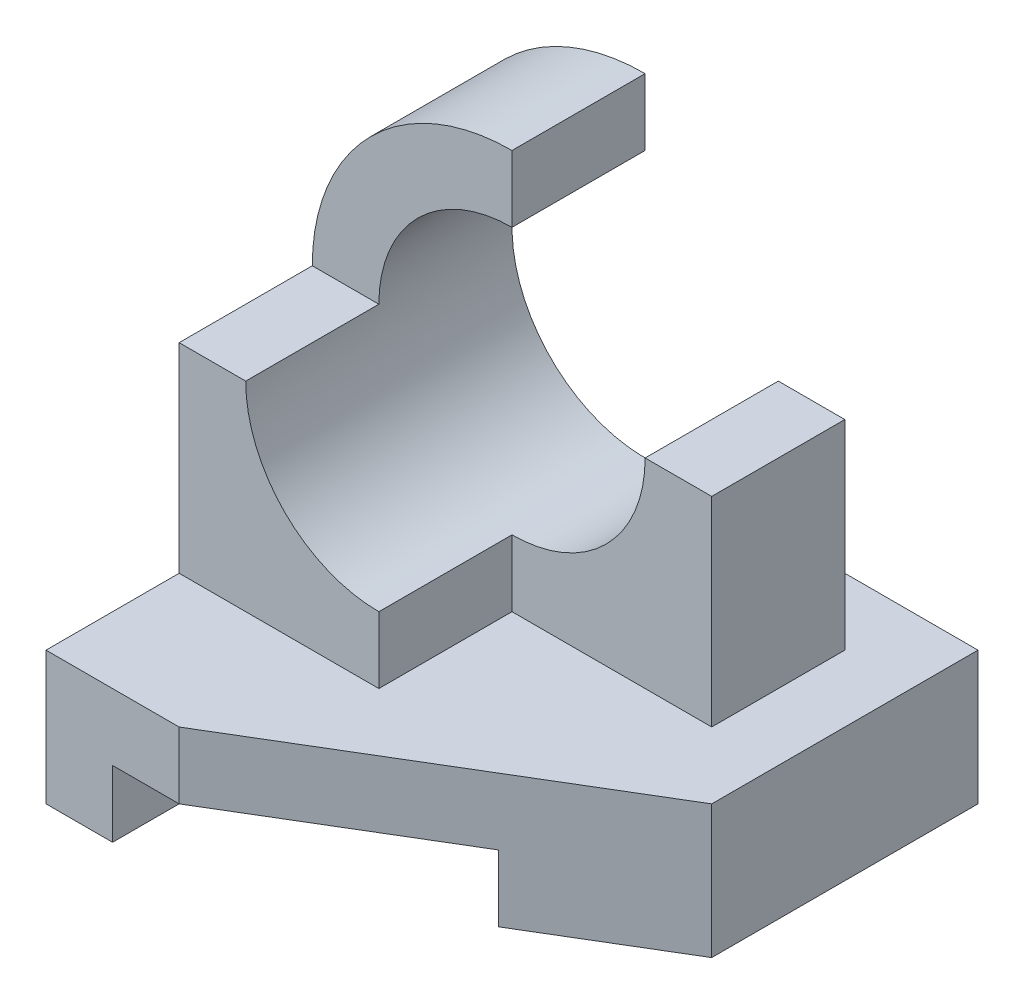
ISO-10303-21;
HEADER;
FILE_DESCRIPTION(('STEP AP214'),'2;1');
FILE_NAME('part.step','',(''),(''),'','','');
FILE_SCHEMA(('AUTOMOTIVE_DESIGN { 1 0 10303 214 1 1 1 1 }'));
ENDSEC;
DATA;
#1=APPLICATION_CONTEXT('core data for automotive mechanical design processes');
#2=APPLICATION_PROTOCOL_DEFINITION('international standard','automotive_design',2000,#1);
#3=PRODUCT_CONTEXT('',#1,'mechanical');
#4=PRODUCT('Part','Part','',(#3));
#5=PRODUCT_RELATED_PRODUCT_CATEGORY('part','',(#4));
#6=PRODUCT_DEFINITION_FORMATION('','',#4);
#7=PRODUCT_DEFINITION_CONTEXT('part definition',#1,'design');
#8=PRODUCT_DEFINITION('design','',#6,#7);
#9=PRODUCT_DEFINITION_SHAPE('','',#8);
#10=(LENGTH_UNIT() NAMED_UNIT(*) SI_UNIT(.MILLI.,.METRE.));
#11=(NAMED_UNIT(*) PLANE_ANGLE_UNIT() SI_UNIT($,.RADIAN.));
#12=(NAMED_UNIT(*) SI_UNIT($,.STERADIAN.) SOLID_ANGLE_UNIT());
#13=UNCERTAINTY_MEASURE_WITH_UNIT(LENGTH_MEASURE(1.E-05),#10,'distance_accuracy_value','');
#14=(GEOMETRIC_REPRESENTATION_CONTEXT(3) GLOBAL_UNCERTAINTY_ASSIGNED_CONTEXT((#13)) GLOBAL_UNIT_ASSIGNED_CONTEXT((#10,
#11,#12)) REPRESENTATION_CONTEXT('',''));
#15=CARTESIAN_POINT('',(0.,0.,0.));
#16=DIRECTION('',(0.,0.,1.));
#17=DIRECTION('',(1.,0.,0.));
#18=AXIS2_PLACEMENT_3D('',#15,#16,#17);
#19=CARTESIAN_POINT('',(3.5,1.,7.));
#20=DIRECTION('',(0.,-1.,0.));
#21=DIRECTION('',(1.,0.,0.));
#22=AXIS2_PLACEMENT_3D('',#19,#20,#21);
#23=PLANE('',#22);
#24=DIRECTION('',(0.,0.,-1.));
#25=VECTOR('',#24,1.);
#26=CARTESIAN_POINT('',(-3.5,1.,7.));
#27=LINE('',#26,#25);
#28=CARTESIAN_POINT('',(-3.5,1.,1.));
#29=VERTEX_POINT('',#28);
#30=CARTESIAN_POINT('',(-3.5,1.,0.));
#31=VERTEX_POINT('',#30);
#32=EDGE_CURVE('E39',#29,#31,#27,.T.);
#33=ORIENTED_EDGE('',*,*,#32,.F.);
#34=DIRECTION('',(-1.,0.,0.));
#35=VECTOR('',#34,1.);
#36=CARTESIAN_POINT('',(0.,1.,1.));
#37=LINE('',#36,#35);
#38=CARTESIAN_POINT('',(2.5,1.,1.));
#39=VERTEX_POINT('',#38);
#40=EDGE_CURVE('E319',#39,#29,#37,.T.);
#41=ORIENTED_EDGE('',*,*,#40,.F.);
#42=DIRECTION('',(0.,0.,1.));
#43=VECTOR('',#42,1.);
#44=CARTESIAN_POINT('',(2.5,1.,1.));
#45=LINE('',#44,#43);
#46=CARTESIAN_POINT('',(2.5,1.,3.));
#47=VERTEX_POINT('',#46);
#48=EDGE_CURVE('E358',#39,#47,#45,.T.);
#49=ORIENTED_EDGE('',*,*,#48,.T.);
#50=DIRECTION('',(-1.,0.,0.));
#51=VECTOR('',#50,1.);
#52=CARTESIAN_POINT('',(0.,1.,3.));
#53=LINE('',#52,#51);
#54=CARTESIAN_POINT('',(-0.500000000000004,1.,3.));
#55=VERTEX_POINT('',#54);
#56=EDGE_CURVE('E344',#47,#55,#53,.T.);
#57=ORIENTED_EDGE('',*,*,#56,.T.);
#58=DIRECTION('',(0.,0.,-1.));
#59=VECTOR('',#58,1.);
#60=CARTESIAN_POINT('',(-0.500000000000004,1.,3.));
#61=LINE('',#60,#59);
#62=CARTESIAN_POINT('',(-0.500000000000004,1.,5.));
#63=VERTEX_POINT('',#62);
#64=EDGE_CURVE('E198',#63,#55,#61,.T.);
#65=ORIENTED_EDGE('',*,*,#64,.F.);
#66=DIRECTION('',(1.,0.,0.));
#67=VECTOR('',#66,1.);
#68=CARTESIAN_POINT('',(-0.500000000000004,1.,5.));
#69=LINE('',#68,#67);
#70=CARTESIAN_POINT('',(-3.5,1.,5.));
#71=VERTEX_POINT('',#70);
#72=EDGE_CURVE('E60',#71,#63,#69,.T.);
#73=ORIENTED_EDGE('',*,*,#72,.F.);
#74=CARTESIAN_POINT('',(-3.5,1.,7.));
#75=VERTEX_POINT('',#74);
#76=EDGE_CURVE('E269',#75,#71,#27,.T.);
#77=ORIENTED_EDGE('',*,*,#76,.F.);
#78=DIRECTION('',(-1.,0.,0.));
#79=VECTOR('',#78,1.);
#80=CARTESIAN_POINT('',(3.5,1.,7.));
#81=LINE('',#80,#79);
#82=CARTESIAN_POINT('',(-1.5,1.,7.));
#83=VERTEX_POINT('',#82);
#84=EDGE_CURVE('E251',#83,#75,#81,.T.);
#85=ORIENTED_EDGE('',*,*,#84,.F.);
#86=DIRECTION('',(-0.857492925712544,0.,0.514495755427526));
#87=VECTOR('',#86,1.);
#88=CARTESIAN_POINT('',(3.5,1.,4.));
#89=LINE('',#88,#87);
#90=CARTESIAN_POINT('',(3.5,1.,4.));
#91=VERTEX_POINT('',#90);
#92=EDGE_CURVE('E226',#91,#83,#89,.T.);
#93=ORIENTED_EDGE('',*,*,#92,.F.);
#94=DIRECTION('',(0.,0.,-1.));
#95=VECTOR('',#94,1.);
#96=CARTESIAN_POINT('',(3.5,1.,7.));
#97=LINE('',#96,#95);
#98=CARTESIAN_POINT('',(3.5,1.,0.));
#99=VERTEX_POINT('',#98);
#100=EDGE_CURVE('E265',#91,#99,#97,.T.);
#101=ORIENTED_EDGE('',*,*,#100,.T.);
#102=DIRECTION('',(-1.,0.,0.));
#103=VECTOR('',#102,1.);
#104=CARTESIAN_POINT('',(3.5,1.,0.));
#105=LINE('',#104,#103);
#106=EDGE_CURVE('E248',#99,#31,#105,.T.);
#107=ORIENTED_EDGE('',*,*,#106,.T.);
#108=EDGE_LOOP('',(#33,#41,#49,#57,#65,#73,#77,#85,#93,#101,#107));
#109=FACE_BOUND('',#108,.T.);
#110=ADVANCED_FACE('F35',(#109),#23,.F.);
#111=CARTESIAN_POINT('',(3.5,-0.999999999999999,7.));
#112=DIRECTION('',(0.,1.,0.));
#113=DIRECTION('',(-1.,0.,0.));
#114=AXIS2_PLACEMENT_3D('',#111,#112,#113);
#115=PLANE('',#114);
#116=DIRECTION('',(1.,0.,0.));
#117=VECTOR('',#116,1.);
#118=CARTESIAN_POINT('',(3.5,-0.999999999999999,0.));
#119=LINE('',#118,#117);
#120=CARTESIAN_POINT('',(-3.5,-1.,0.));
#121=VERTEX_POINT('',#120);
#122=CARTESIAN_POINT('',(-2.5,-1.,0.));
#123=VERTEX_POINT('',#122);
#124=EDGE_CURVE('E256',#121,#123,#119,.T.);
#125=ORIENTED_EDGE('',*,*,#124,.T.);
#126=DIRECTION('',(0.,0.,1.));
#127=VECTOR('',#126,1.);
#128=CARTESIAN_POINT('',(-2.5,-1.,0.));
#129=LINE('',#128,#127);
#130=CARTESIAN_POINT('',(-2.5,-1.,7.));
#131=VERTEX_POINT('',#130);
#132=EDGE_CURVE('E223',#123,#131,#129,.T.);
#133=ORIENTED_EDGE('',*,*,#132,.T.);
#134=DIRECTION('',(1.,0.,0.));
#135=VECTOR('',#134,1.);
#136=CARTESIAN_POINT('',(3.5,-0.999999999999999,7.));
#137=LINE('',#136,#135);
#138=CARTESIAN_POINT('',(-3.5,-1.,7.));
#139=VERTEX_POINT('',#138);
#140=EDGE_CURVE('E247',#139,#131,#137,.T.);
#141=ORIENTED_EDGE('',*,*,#140,.F.);
#142=DIRECTION('',(0.,0.,-1.));
#143=VECTOR('',#142,1.);
#144=CARTESIAN_POINT('',(-3.5,-1.,7.));
#145=LINE('',#144,#143);
#146=EDGE_CURVE('E304',#139,#121,#145,.T.);
#147=ORIENTED_EDGE('',*,*,#146,.T.);
#148=EDGE_LOOP('',(#125,#133,#141,#147));
#149=FACE_BOUND('',#148,.T.);
#150=ADVANCED_FACE('F380',(#149),#115,.F.);
#151=CARTESIAN_POINT('',(-3.5,-1.,7.));
#152=DIRECTION('',(1.,0.,0.));
#153=DIRECTION('',(0.,0.,-1.));
#154=AXIS2_PLACEMENT_3D('',#151,#152,#153);
#155=PLANE('',#154);
#156=DIRECTION('',(0.,1.,0.));
#157=VECTOR('',#156,1.);
#158=CARTESIAN_POINT('',(-3.5,0.,1.));
#159=LINE('',#158,#157);
#160=CARTESIAN_POINT('',(-3.5,4.,1.));
#161=VERTEX_POINT('',#160);
#162=EDGE_CURVE('E320',#29,#161,#159,.T.);
#163=ORIENTED_EDGE('',*,*,#162,.F.);
#164=ORIENTED_EDGE('',*,*,#32,.T.);
#165=DIRECTION('',(0.,-1.,0.));
#166=VECTOR('',#165,1.);
#167=CARTESIAN_POINT('',(-3.5,-1.,0.));
#168=LINE('',#167,#166);
#169=EDGE_CURVE('E242',#31,#121,#168,.T.);
#170=ORIENTED_EDGE('',*,*,#169,.T.);
#171=ORIENTED_EDGE('',*,*,#146,.F.);
#172=DIRECTION('',(0.,-1.,0.));
#173=VECTOR('',#172,1.);
#174=CARTESIAN_POINT('',(-3.5,-1.,7.));
#175=LINE('',#174,#173);
#176=EDGE_CURVE('E244',#75,#139,#175,.T.);
#177=ORIENTED_EDGE('',*,*,#176,.F.);
#178=ORIENTED_EDGE('',*,*,#76,.T.);
#179=DIRECTION('',(0.,-1.,0.));
#180=VECTOR('',#179,1.);
#181=CARTESIAN_POINT('',(-3.5,4.,5.));
#182=LINE('',#181,#180);
#183=CARTESIAN_POINT('',(-3.5,4.,5.));
#184=VERTEX_POINT('',#183);
#185=EDGE_CURVE('E206',#184,#71,#182,.T.);
#186=ORIENTED_EDGE('',*,*,#185,.F.);
#187=DIRECTION('',(0.,0.,1.));
#188=VECTOR('',#187,1.);
#189=CARTESIAN_POINT('',(-3.5,4.,5.));
#190=LINE('',#189,#188);
#191=CARTESIAN_POINT('',(-3.5,4.,3.));
#192=VERTEX_POINT('',#191);
#193=EDGE_CURVE('E195',#192,#184,#190,.T.);
#194=ORIENTED_EDGE('',*,*,#193,.F.);
#195=DIRECTION('',(0.,0.,1.));
#196=VECTOR('',#195,1.);
#197=CARTESIAN_POINT('',(-3.5,4.,1.));
#198=LINE('',#197,#196);
#199=EDGE_CURVE('E322',#161,#192,#198,.T.);
#200=ORIENTED_EDGE('',*,*,#199,.F.);
#201=EDGE_LOOP('',(#163,#164,#170,#171,#177,#178,#186,#194,#200));
#202=FACE_BOUND('',#201,.T.);
#203=ADVANCED_FACE('F37',(#202),#155,.F.);
#204=DIRECTION('',(-0.857492925712544,0.,0.514495755427526));
#205=VECTOR('',#204,1.);
#206=CARTESIAN_POINT('',(3.5,-1.,4.));
#207=LINE('',#206,#205);
#208=CARTESIAN_POINT('',(3.5,-1.,4.));
#209=VERTEX_POINT('',#208);
#210=CARTESIAN_POINT('',(1.5,-1.,5.2));
#211=VERTEX_POINT('',#210);
#212=EDGE_CURVE('E234',#209,#211,#207,.T.);
#213=ORIENTED_EDGE('',*,*,#212,.T.);
#214=DIRECTION('',(0.,0.,1.));
#215=VECTOR('',#214,1.);
#216=CARTESIAN_POINT('',(1.5,-1.,0.));
#217=LINE('',#216,#215);
#218=CARTESIAN_POINT('',(1.5,-1.,0.));
#219=VERTEX_POINT('',#218);
#220=EDGE_CURVE('E220',#219,#211,#217,.T.);
#221=ORIENTED_EDGE('',*,*,#220,.F.);
#222=CARTESIAN_POINT('',(3.5,-0.999999999999999,0.));
#223=VERTEX_POINT('',#222);
#224=EDGE_CURVE('E255',#219,#223,#119,.T.);
#225=ORIENTED_EDGE('',*,*,#224,.T.);
#226=DIRECTION('',(0.,0.,-1.));
#227=VECTOR('',#226,1.);
#228=CARTESIAN_POINT('',(3.5,-0.999999999999999,7.));
#229=LINE('',#228,#227);
#230=EDGE_CURVE('E298',#209,#223,#229,.T.);
#231=ORIENTED_EDGE('',*,*,#230,.F.);
#232=EDGE_LOOP('',(#213,#221,#225,#231));
#233=FACE_BOUND('',#232,.T.);
#234=ADVANCED_FACE('F301',(#233),#115,.F.);
#235=CARTESIAN_POINT('',(3.5,-0.999999999999999,7.));
#236=DIRECTION('',(-1.,0.,0.));
#237=DIRECTION('',(0.,0.,1.));
#238=AXIS2_PLACEMENT_3D('',#235,#236,#237);
#239=PLANE('',#238);
#240=ORIENTED_EDGE('',*,*,#100,.F.);
#241=DIRECTION('',(0.,1.,0.));
#242=VECTOR('',#241,1.);
#243=CARTESIAN_POINT('',(3.5,-1.,4.));
#244=LINE('',#243,#242);
#245=EDGE_CURVE('E237',#209,#91,#244,.T.);
#246=ORIENTED_EDGE('',*,*,#245,.F.);
#247=ORIENTED_EDGE('',*,*,#230,.T.);
#248=DIRECTION('',(0.,1.,0.));
#249=VECTOR('',#248,1.);
#250=CARTESIAN_POINT('',(3.5,-0.999999999999999,0.));
#251=LINE('',#250,#249);
#252=EDGE_CURVE('E259',#223,#99,#251,.T.);
#253=ORIENTED_EDGE('',*,*,#252,.T.);
#254=EDGE_LOOP('',(#240,#246,#247,#253));
#255=FACE_BOUND('',#254,.T.);
#256=ADVANCED_FACE('F297',(#255),#239,.F.);
#257=CARTESIAN_POINT('',(0.,0.,7.));
#258=DIRECTION('',(0.,0.,1.));
#259=DIRECTION('',(1.,0.,0.));
#260=AXIS2_PLACEMENT_3D('',#257,#258,#259);
#261=PLANE('',#260);
#262=DIRECTION('',(0.,-1.,0.));
#263=VECTOR('',#262,1.);
#264=CARTESIAN_POINT('',(-2.5,-1.,7.));
#265=LINE('',#264,#263);
#266=CARTESIAN_POINT('',(-2.5,0.,7.));
#267=VERTEX_POINT('',#266);
#268=EDGE_CURVE('E214',#267,#131,#265,.T.);
#269=ORIENTED_EDGE('',*,*,#268,.F.);
#270=DIRECTION('',(-1.,0.,0.));
#271=VECTOR('',#270,1.);
#272=CARTESIAN_POINT('',(-2.5,0.,7.));
#273=LINE('',#272,#271);
#274=CARTESIAN_POINT('',(-1.50000000000001,0.,7.));
#275=VERTEX_POINT('',#274);
#276=EDGE_CURVE('E209',#275,#267,#273,.T.);
#277=ORIENTED_EDGE('',*,*,#276,.F.);
#278=DIRECTION('',(0.,1.,0.));
#279=VECTOR('',#278,1.);
#280=CARTESIAN_POINT('',(-1.5,-1.,7.));
#281=LINE('',#280,#279);
#282=EDGE_CURVE('E240',#275,#83,#281,.T.);
#283=ORIENTED_EDGE('',*,*,#282,.T.);
#284=ORIENTED_EDGE('',*,*,#84,.T.);
#285=ORIENTED_EDGE('',*,*,#176,.T.);
#286=ORIENTED_EDGE('',*,*,#140,.T.);
#287=EDGE_LOOP('',(#269,#277,#283,#284,#285,#286));
#288=FACE_BOUND('',#287,.T.);
#289=ADVANCED_FACE('F287',(#288),#261,.T.);
#290=CARTESIAN_POINT('',(0.,0.,0.));
#291=DIRECTION('',(0.,0.,1.));
#292=DIRECTION('',(1.,0.,0.));
#293=AXIS2_PLACEMENT_3D('',#290,#291,#292);
#294=PLANE('',#293);
#295=DIRECTION('',(-1.,0.,0.));
#296=VECTOR('',#295,1.);
#297=CARTESIAN_POINT('',(-2.5,0.,0.));
#298=LINE('',#297,#296);
#299=CARTESIAN_POINT('',(1.5,0.,0.));
#300=VERTEX_POINT('',#299);
#301=CARTESIAN_POINT('',(-2.5,0.,0.));
#302=VERTEX_POINT('',#301);
#303=EDGE_CURVE('E213',#300,#302,#298,.T.);
#304=ORIENTED_EDGE('',*,*,#303,.T.);
#305=DIRECTION('',(0.,-1.,0.));
#306=VECTOR('',#305,1.);
#307=CARTESIAN_POINT('',(-2.5,-1.,0.));
#308=LINE('',#307,#306);
#309=EDGE_CURVE('E217',#302,#123,#308,.T.);
#310=ORIENTED_EDGE('',*,*,#309,.T.);
#311=ORIENTED_EDGE('',*,*,#124,.F.);
#312=ORIENTED_EDGE('',*,*,#169,.F.);
#313=ORIENTED_EDGE('',*,*,#106,.F.);
#314=ORIENTED_EDGE('',*,*,#252,.F.);
#315=ORIENTED_EDGE('',*,*,#224,.F.);
#316=DIRECTION('',(0.,1.,0.));
#317=VECTOR('',#316,1.);
#318=CARTESIAN_POINT('',(1.5,0.,0.));
#319=LINE('',#318,#317);
#320=EDGE_CURVE('E210',#219,#300,#319,.T.);
#321=ORIENTED_EDGE('',*,*,#320,.T.);
#322=EDGE_LOOP('',(#304,#310,#311,#312,#313,#314,#315,#321));
#323=FACE_BOUND('',#322,.T.);
#324=ADVANCED_FACE('F314',(#323),#294,.F.);
#325=CARTESIAN_POINT('',(3.5,-1.,4.));
#326=DIRECTION('',(-0.514495755427526,0.,-0.857492925712544));
#327=DIRECTION('',(-0.857492925712544,0.,0.514495755427526));
#328=AXIS2_PLACEMENT_3D('',#325,#326,#327);
#329=PLANE('',#328);
#330=ORIENTED_EDGE('',*,*,#282,.F.);
#331=DIRECTION('',(0.857492925712544,0.,-0.514495755427526));
#332=VECTOR('',#331,1.);
#333=CARTESIAN_POINT('',(3.5,0.,4.));
#334=LINE('',#333,#332);
#335=CARTESIAN_POINT('',(1.5,0.,5.2));
#336=VERTEX_POINT('',#335);
#337=EDGE_CURVE('E11',#275,#336,#334,.T.);
#338=ORIENTED_EDGE('',*,*,#337,.T.);
#339=DIRECTION('',(0.,-1.,0.));
#340=VECTOR('',#339,1.);
#341=CARTESIAN_POINT('',(1.5,-1.,5.2));
#342=LINE('',#341,#340);
#343=EDGE_CURVE('E45',#336,#211,#342,.T.);
#344=ORIENTED_EDGE('',*,*,#343,.T.);
#345=ORIENTED_EDGE('',*,*,#212,.F.);
#346=ORIENTED_EDGE('',*,*,#245,.T.);
#347=ORIENTED_EDGE('',*,*,#92,.T.);
#348=EDGE_LOOP('',(#330,#338,#344,#345,#346,#347));
#349=FACE_BOUND('',#348,.T.);
#350=ADVANCED_FACE('F291',(#349),#329,.F.);
#351=CARTESIAN_POINT('',(-2.5,0.,0.));
#352=DIRECTION('',(0.,1.,0.));
#353=DIRECTION('',(-1.,0.,0.));
#354=AXIS2_PLACEMENT_3D('',#351,#352,#353);
#355=PLANE('',#354);
#356=ORIENTED_EDGE('',*,*,#276,.T.);
#357=DIRECTION('',(0.,0.,1.));
#358=VECTOR('',#357,1.);
#359=CARTESIAN_POINT('',(-2.5,0.,0.));
#360=LINE('',#359,#358);
#361=EDGE_CURVE('E227',#302,#267,#360,.T.);
#362=ORIENTED_EDGE('',*,*,#361,.F.);
#363=ORIENTED_EDGE('',*,*,#303,.F.);
#364=DIRECTION('',(0.,0.,1.));
#365=VECTOR('',#364,1.);
#366=CARTESIAN_POINT('',(1.5,0.,0.));
#367=LINE('',#366,#365);
#368=EDGE_CURVE('E230',#300,#336,#367,.T.);
#369=ORIENTED_EDGE('',*,*,#368,.T.);
#370=ORIENTED_EDGE('',*,*,#337,.F.);
#371=EDGE_LOOP('',(#356,#362,#363,#369,#370));
#372=FACE_BOUND('',#371,.T.);
#373=ADVANCED_FACE('F311',(#372),#355,.F.);
#374=CARTESIAN_POINT('',(1.5,0.,0.));
#375=DIRECTION('',(1.,0.,0.));
#376=DIRECTION('',(0.,0.,-1.));
#377=AXIS2_PLACEMENT_3D('',#374,#375,#376);
#378=PLANE('',#377);
#379=ORIENTED_EDGE('',*,*,#368,.F.);
#380=ORIENTED_EDGE('',*,*,#320,.F.);
#381=ORIENTED_EDGE('',*,*,#220,.T.);
#382=ORIENTED_EDGE('',*,*,#343,.F.);
#383=EDGE_LOOP('',(#379,#380,#381,#382));
#384=FACE_BOUND('',#383,.T.);
#385=ADVANCED_FACE('F308',(#384),#378,.F.);
#386=CARTESIAN_POINT('',(-2.5,-1.,0.));
#387=DIRECTION('',(-1.,0.,0.));
#388=DIRECTION('',(0.,0.,1.));
#389=AXIS2_PLACEMENT_3D('',#386,#387,#388);
#390=PLANE('',#389);
#391=ORIENTED_EDGE('',*,*,#268,.T.);
#392=ORIENTED_EDGE('',*,*,#132,.F.);
#393=ORIENTED_EDGE('',*,*,#309,.F.);
#394=ORIENTED_EDGE('',*,*,#361,.T.);
#395=EDGE_LOOP('',(#391,#392,#393,#394));
#396=FACE_BOUND('',#395,.T.);
#397=ADVANCED_FACE('F377',(#396),#390,.F.);
#398=CARTESIAN_POINT('',(-0.500000000000004,4.,5.));
#399=DIRECTION('',(0.,0.,-1.));
#400=DIRECTION('',(-1.,0.,0.));
#401=AXIS2_PLACEMENT_3D('',#398,#399,#400);
#402=PLANE('',#401);
#403=DIRECTION('',(0.,-1.,0.));
#404=VECTOR('',#403,1.);
#405=CARTESIAN_POINT('',(-0.500000000000004,4.,5.));
#406=LINE('',#405,#404);
#407=CARTESIAN_POINT('',(-0.500000000000004,2.,5.));
#408=VERTEX_POINT('',#407);
#409=EDGE_CURVE('E53',#408,#63,#406,.T.);
#410=ORIENTED_EDGE('',*,*,#409,.F.);
#411=CARTESIAN_POINT('',(-0.500000000000004,4.,5.));
#412=DIRECTION('',(0.,0.,-1.));
#413=DIRECTION('',(-1.,0.,0.));
#414=AXIS2_PLACEMENT_3D('',#411,#412,#413);
#415=CIRCLE('',#414,2.);
#416=CARTESIAN_POINT('',(-2.5,4.,5.));
#417=VERTEX_POINT('',#416);
#418=EDGE_CURVE('E178',#408,#417,#415,.T.);
#419=ORIENTED_EDGE('',*,*,#418,.T.);
#420=DIRECTION('',(1.,0.,0.));
#421=VECTOR('',#420,1.);
#422=CARTESIAN_POINT('',(-0.500000000000004,4.,5.));
#423=LINE('',#422,#421);
#424=EDGE_CURVE('E190',#184,#417,#423,.T.);
#425=ORIENTED_EDGE('',*,*,#424,.F.);
#426=ORIENTED_EDGE('',*,*,#185,.T.);
#427=ORIENTED_EDGE('',*,*,#72,.T.);
#428=EDGE_LOOP('',(#410,#419,#425,#426,#427));
#429=FACE_BOUND('',#428,.T.);
#430=ADVANCED_FACE('F188',(#429),#402,.F.);
#431=CARTESIAN_POINT('',(-0.500000000000004,4.,3.));
#432=DIRECTION('',(-1.,0.,0.));
#433=DIRECTION('',(0.,-1.,0.));
#434=AXIS2_PLACEMENT_3D('',#431,#432,#433);
#435=PLANE('',#434);
#436=DIRECTION('',(0.,-1.,0.));
#437=VECTOR('',#436,1.);
#438=CARTESIAN_POINT('',(-0.500000000000004,4.,3.));
#439=LINE('',#438,#437);
#440=CARTESIAN_POINT('',(-0.500000000000004,2.,3.));
#441=VERTEX_POINT('',#440);
#442=EDGE_CURVE('E203',#441,#55,#439,.T.);
#443=ORIENTED_EDGE('',*,*,#442,.F.);
#444=DIRECTION('',(0.,0.,-1.));
#445=VECTOR('',#444,1.);
#446=CARTESIAN_POINT('',(-0.500000000000004,2.,6.));
#447=LINE('',#446,#445);
#448=EDGE_CURVE('E191',#441,#408,#447,.F.);
#449=ORIENTED_EDGE('',*,*,#448,.T.);
#450=ORIENTED_EDGE('',*,*,#409,.T.);
#451=ORIENTED_EDGE('',*,*,#64,.T.);
#452=EDGE_LOOP('',(#443,#449,#450,#451));
#453=FACE_BOUND('',#452,.T.);
#454=ADVANCED_FACE('F369',(#453),#435,.F.);
#455=CARTESIAN_POINT('',(0.,4.,0.));
#456=DIRECTION('',(0.,-1.,0.));
#457=DIRECTION('',(1.,0.,0.));
#458=AXIS2_PLACEMENT_3D('',#455,#456,#457);
#459=PLANE('',#458);
#460=ORIENTED_EDGE('',*,*,#424,.T.);
#461=DIRECTION('',(0.,0.,-1.));
#462=VECTOR('',#461,1.);
#463=CARTESIAN_POINT('',(-2.5,4.,6.));
#464=LINE('',#463,#462);
#465=CARTESIAN_POINT('',(-2.5,4.,3.));
#466=VERTEX_POINT('',#465);
#467=EDGE_CURVE('E174',#417,#466,#464,.T.);
#468=ORIENTED_EDGE('',*,*,#467,.T.);
#469=DIRECTION('',(-1.,0.,0.));
#470=VECTOR('',#469,1.);
#471=CARTESIAN_POINT('',(-3.5,4.,3.));
#472=LINE('',#471,#470);
#473=EDGE_CURVE('E197',#466,#192,#472,.T.);
#474=ORIENTED_EDGE('',*,*,#473,.T.);
#475=ORIENTED_EDGE('',*,*,#193,.T.);
#476=EDGE_LOOP('',(#460,#468,#474,#475));
#477=FACE_BOUND('',#476,.T.);
#478=ADVANCED_FACE('F193',(#477),#459,.F.);
#479=CARTESIAN_POINT('',(0.,0.,3.));
#480=DIRECTION('',(0.,0.,-1.));
#481=DIRECTION('',(-1.,0.,0.));
#482=AXIS2_PLACEMENT_3D('',#479,#480,#481);
#483=PLANE('',#482);
#484=CARTESIAN_POINT('',(-0.500000000000004,4.,3.));
#485=DIRECTION('',(0.,0.,-1.));
#486=DIRECTION('',(-1.,0.,0.));
#487=AXIS2_PLACEMENT_3D('',#484,#485,#486);
#488=CIRCLE('',#487,2.);
#489=CARTESIAN_POINT('',(1.5,4.,3.));
#490=VERTEX_POINT('',#489);
#491=EDGE_CURVE('E335',#490,#441,#488,.T.);
#492=ORIENTED_EDGE('',*,*,#491,.T.);
#493=ORIENTED_EDGE('',*,*,#442,.T.);
#494=ORIENTED_EDGE('',*,*,#56,.F.);
#495=DIRECTION('',(0.,1.,0.));
#496=VECTOR('',#495,1.);
#497=CARTESIAN_POINT('',(2.5,0.,3.));
#498=LINE('',#497,#496);
#499=CARTESIAN_POINT('',(2.5,4.,3.));
#500=VERTEX_POINT('',#499);
#501=EDGE_CURVE('E341',#47,#500,#498,.T.);
#502=ORIENTED_EDGE('',*,*,#501,.T.);
#503=DIRECTION('',(-1.,0.,0.));
#504=VECTOR('',#503,1.);
#505=CARTESIAN_POINT('',(0.,4.,3.));
#506=LINE('',#505,#504);
#507=EDGE_CURVE('E338',#500,#490,#506,.T.);
#508=ORIENTED_EDGE('',*,*,#507,.T.);
#509=EDGE_LOOP('',(#492,#493,#494,#502,#508));
#510=FACE_BOUND('',#509,.T.);
#511=ADVANCED_FACE('F367',(#510),#483,.F.);
#512=CARTESIAN_POINT('',(-0.500000000000004,4.,3.));
#513=DIRECTION('',(0.,0.,-1.));
#514=DIRECTION('',(-1.,0.,0.));
#515=AXIS2_PLACEMENT_3D('',#512,#513,#514);
#516=CIRCLE('',#515,3.);
#517=CARTESIAN_POINT('',(-0.500000000000005,7.,3.));
#518=VERTEX_POINT('',#517);
#519=EDGE_CURVE('E347',#192,#518,#516,.T.);
#520=ORIENTED_EDGE('',*,*,#519,.F.);
#521=ORIENTED_EDGE('',*,*,#473,.F.);
#522=CARTESIAN_POINT('',(-0.500000000000004,6.,3.));
#523=VERTEX_POINT('',#522);
#524=EDGE_CURVE('E180',#466,#523,#488,.T.);
#525=ORIENTED_EDGE('',*,*,#524,.T.);
#526=DIRECTION('',(0.,-1.,0.));
#527=VECTOR('',#526,1.);
#528=CARTESIAN_POINT('',(-0.500000000000002,0.,3.));
#529=LINE('',#528,#527);
#530=EDGE_CURVE('E349',#518,#523,#529,.T.);
#531=ORIENTED_EDGE('',*,*,#530,.F.);
#532=EDGE_LOOP('',(#520,#521,#525,#531));
#533=FACE_BOUND('',#532,.T.);
#534=ADVANCED_FACE('F493',(#533),#483,.F.);
#535=CARTESIAN_POINT('',(-0.500000000000004,4.,1.));
#536=DIRECTION('',(0.,0.,1.));
#537=DIRECTION('',(1.,0.,0.));
#538=AXIS2_PLACEMENT_3D('',#535,#536,#537);
#539=CYLINDRICAL_SURFACE('',#538,2.);
#540=ORIENTED_EDGE('',*,*,#491,.F.);
#541=DIRECTION('',(0.,0.,1.));
#542=VECTOR('',#541,1.);
#543=CARTESIAN_POINT('',(1.5,4.,1.));
#544=LINE('',#543,#542);
#545=CARTESIAN_POINT('',(1.5,4.,1.));
#546=VERTEX_POINT('',#545);
#547=EDGE_CURVE('E361',#546,#490,#544,.T.);
#548=ORIENTED_EDGE('',*,*,#547,.F.);
#549=CARTESIAN_POINT('',(-0.500000000000004,4.,1.));
#550=DIRECTION('',(0.,0.,-1.));
#551=DIRECTION('',(-1.,0.,0.));
#552=AXIS2_PLACEMENT_3D('',#549,#550,#551);
#553=CIRCLE('',#552,2.);
#554=CARTESIAN_POINT('',(-0.500000000000004,6.,1.));
#555=VERTEX_POINT('',#554);
#556=EDGE_CURVE('E352',#546,#555,#553,.T.);
#557=ORIENTED_EDGE('',*,*,#556,.T.);
#558=DIRECTION('',(0.,0.,1.));
#559=VECTOR('',#558,1.);
#560=CARTESIAN_POINT('',(-0.500000000000004,6.,1.));
#561=LINE('',#560,#559);
#562=EDGE_CURVE('E334',#555,#523,#561,.T.);
#563=ORIENTED_EDGE('',*,*,#562,.T.);
#564=ORIENTED_EDGE('',*,*,#524,.F.);
#565=ORIENTED_EDGE('',*,*,#467,.F.);
#566=ORIENTED_EDGE('',*,*,#418,.F.);
#567=ORIENTED_EDGE('',*,*,#448,.F.);
#568=EDGE_LOOP('',(#540,#548,#557,#563,#564,#565,#566,#567));
#569=FACE_BOUND('',#568,.T.);
#570=ADVANCED_FACE('F177',(#569),#539,.F.);
#571=CARTESIAN_POINT('',(0.,4.,1.));
#572=DIRECTION('',(0.,1.,0.));
#573=DIRECTION('',(0.,0.,1.));
#574=AXIS2_PLACEMENT_3D('',#571,#572,#573);
#575=PLANE('',#574);
#576=ORIENTED_EDGE('',*,*,#507,.F.);
#577=DIRECTION('',(0.,0.,1.));
#578=VECTOR('',#577,1.);
#579=CARTESIAN_POINT('',(2.5,4.,1.));
#580=LINE('',#579,#578);
#581=CARTESIAN_POINT('',(2.5,4.,1.));
#582=VERTEX_POINT('',#581);
#583=EDGE_CURVE('E360',#582,#500,#580,.T.);
#584=ORIENTED_EDGE('',*,*,#583,.F.);
#585=DIRECTION('',(-1.,0.,0.));
#586=VECTOR('',#585,1.);
#587=CARTESIAN_POINT('',(0.,4.,1.));
#588=LINE('',#587,#586);
#589=EDGE_CURVE('E578',#582,#546,#588,.T.);
#590=ORIENTED_EDGE('',*,*,#589,.T.);
#591=ORIENTED_EDGE('',*,*,#547,.T.);
#592=EDGE_LOOP('',(#576,#584,#590,#591));
#593=FACE_BOUND('',#592,.T.);
#594=ADVANCED_FACE('F513',(#593),#575,.T.);
#595=CARTESIAN_POINT('',(2.5,0.,1.));
#596=DIRECTION('',(1.,0.,0.));
#597=DIRECTION('',(0.,0.,-1.));
#598=AXIS2_PLACEMENT_3D('',#595,#596,#597);
#599=PLANE('',#598);
#600=ORIENTED_EDGE('',*,*,#501,.F.);
#601=ORIENTED_EDGE('',*,*,#48,.F.);
#602=DIRECTION('',(0.,1.,0.));
#603=VECTOR('',#602,1.);
#604=CARTESIAN_POINT('',(2.5,0.,1.));
#605=LINE('',#604,#603);
#606=EDGE_CURVE('E329',#39,#582,#605,.T.);
#607=ORIENTED_EDGE('',*,*,#606,.T.);
#608=ORIENTED_EDGE('',*,*,#583,.T.);
#609=EDGE_LOOP('',(#600,#601,#607,#608));
#610=FACE_BOUND('',#609,.T.);
#611=ADVANCED_FACE('F522',(#610),#599,.T.);
#612=CARTESIAN_POINT('',(-0.500000000000004,4.,1.));
#613=DIRECTION('',(0.,0.,1.));
#614=DIRECTION('',(1.,0.,0.));
#615=AXIS2_PLACEMENT_3D('',#612,#613,#614);
#616=CYLINDRICAL_SURFACE('',#615,3.);
#617=ORIENTED_EDGE('',*,*,#519,.T.);
#618=DIRECTION('',(0.,0.,1.));
#619=VECTOR('',#618,1.);
#620=CARTESIAN_POINT('',(-0.500000000000005,7.,1.));
#621=LINE('',#620,#619);
#622=CARTESIAN_POINT('',(-0.500000000000005,7.,1.));
#623=VERTEX_POINT('',#622);
#624=EDGE_CURVE('E354',#623,#518,#621,.T.);
#625=ORIENTED_EDGE('',*,*,#624,.F.);
#626=CARTESIAN_POINT('',(-0.500000000000004,4.,1.));
#627=DIRECTION('',(0.,0.,-1.));
#628=DIRECTION('',(-1.,0.,0.));
#629=AXIS2_PLACEMENT_3D('',#626,#627,#628);
#630=CIRCLE('',#629,3.);
#631=EDGE_CURVE('E325',#161,#623,#630,.T.);
#632=ORIENTED_EDGE('',*,*,#631,.F.);
#633=ORIENTED_EDGE('',*,*,#199,.T.);
#634=EDGE_LOOP('',(#617,#625,#632,#633));
#635=FACE_BOUND('',#634,.T.);
#636=ADVANCED_FACE('F529',(#635),#616,.T.);
#637=CARTESIAN_POINT('',(-0.500000000000002,0.,1.));
#638=DIRECTION('',(-1.,0.,0.));
#639=DIRECTION('',(0.,-1.,0.));
#640=AXIS2_PLACEMENT_3D('',#637,#638,#639);
#641=PLANE('',#640);
#642=ORIENTED_EDGE('',*,*,#530,.T.);
#643=ORIENTED_EDGE('',*,*,#562,.F.);
#644=DIRECTION('',(0.,-1.,0.));
#645=VECTOR('',#644,1.);
#646=CARTESIAN_POINT('',(-0.500000000000002,0.,1.));
#647=LINE('',#646,#645);
#648=EDGE_CURVE('E327',#623,#555,#647,.T.);
#649=ORIENTED_EDGE('',*,*,#648,.F.);
#650=ORIENTED_EDGE('',*,*,#624,.T.);
#651=EDGE_LOOP('',(#642,#643,#649,#650));
#652=FACE_BOUND('',#651,.T.);
#653=ADVANCED_FACE('F537',(#652),#641,.F.);
#654=CARTESIAN_POINT('',(0.,0.,1.));
#655=DIRECTION('',(0.,0.,-1.));
#656=DIRECTION('',(-1.,0.,0.));
#657=AXIS2_PLACEMENT_3D('',#654,#655,#656);
#658=PLANE('',#657);
#659=ORIENTED_EDGE('',*,*,#556,.F.);
#660=ORIENTED_EDGE('',*,*,#589,.F.);
#661=ORIENTED_EDGE('',*,*,#606,.F.);
#662=ORIENTED_EDGE('',*,*,#40,.T.);
#663=ORIENTED_EDGE('',*,*,#162,.T.);
#664=ORIENTED_EDGE('',*,*,#631,.T.);
#665=ORIENTED_EDGE('',*,*,#648,.T.);
#666=EDGE_LOOP('',(#659,#660,#661,#662,#663,#664,#665));
#667=FACE_BOUND('',#666,.T.);
#668=ADVANCED_FACE('F545',(#667),#658,.T.);
#669=CLOSED_SHELL('',(#110,#150,#203,#234,#256,#289,#324,#350,#373,#385,#397,#430,#454,#478,
#511,#534,#570,#594,#611,#636,#653,#668));
#670=MANIFOLD_SOLID_BREP('B2',#669);
#671=ADVANCED_BREP_SHAPE_REPRESENTATION('',(#18,#670),#14);
#672=SHAPE_DEFINITION_REPRESENTATION(#9,#671);
ENDSEC;
END-ISO-10303-21;
